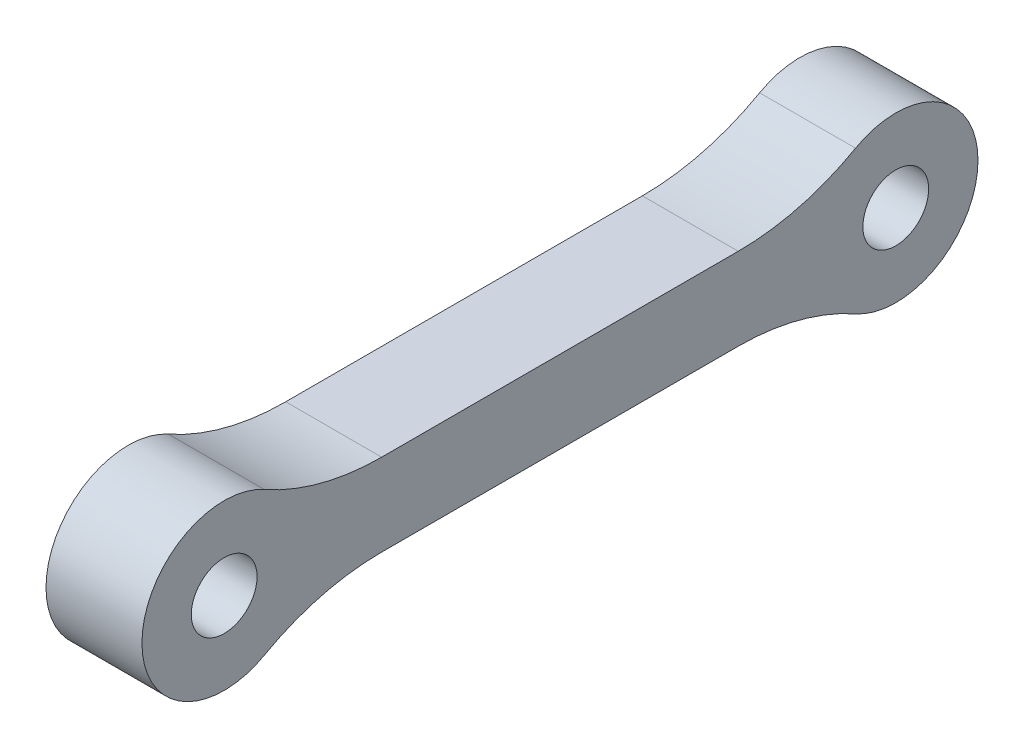
ISO-10303-21;
HEADER;
FILE_DESCRIPTION(('STEP AP214'),'2;1');
FILE_NAME('part.step','',(''),(''),'','','');
FILE_SCHEMA(('AUTOMOTIVE_DESIGN { 1 0 10303 214 1 1 1 1 }'));
ENDSEC;
DATA;
#1=APPLICATION_CONTEXT('core data for automotive mechanical design processes');
#2=APPLICATION_PROTOCOL_DEFINITION('international standard','automotive_design',2000,#1);
#3=PRODUCT_CONTEXT('',#1,'mechanical');
#4=PRODUCT('Part','Part','',(#3));
#5=PRODUCT_RELATED_PRODUCT_CATEGORY('part','',(#4));
#6=PRODUCT_DEFINITION_FORMATION('','',#4);
#7=PRODUCT_DEFINITION_CONTEXT('part definition',#1,'design');
#8=PRODUCT_DEFINITION('design','',#6,#7);
#9=PRODUCT_DEFINITION_SHAPE('','',#8);
#10=(LENGTH_UNIT() NAMED_UNIT(*) SI_UNIT(.MILLI.,.METRE.));
#11=(NAMED_UNIT(*) PLANE_ANGLE_UNIT() SI_UNIT($,.RADIAN.));
#12=(NAMED_UNIT(*) SI_UNIT($,.STERADIAN.) SOLID_ANGLE_UNIT());
#13=UNCERTAINTY_MEASURE_WITH_UNIT(LENGTH_MEASURE(1.E-05),#10,'distance_accuracy_value','');
#14=(GEOMETRIC_REPRESENTATION_CONTEXT(3) GLOBAL_UNCERTAINTY_ASSIGNED_CONTEXT((#13)) GLOBAL_UNIT_ASSIGNED_CONTEXT((#10,
#11,#12)) REPRESENTATION_CONTEXT('',''));
#15=CARTESIAN_POINT('',(0.,0.,0.));
#16=DIRECTION('',(0.,0.,1.));
#17=DIRECTION('',(1.,0.,0.));
#18=AXIS2_PLACEMENT_3D('',#15,#16,#17);
#19=CARTESIAN_POINT('',(4.,0.,0.));
#20=DIRECTION('',(1.,0.,0.));
#21=DIRECTION('',(0.,0.,-1.));
#22=AXIS2_PLACEMENT_3D('',#19,#20,#21);
#23=PLANE('',#22);
#24=CARTESIAN_POINT('',(4.,0.,0.));
#25=DIRECTION('',(1.,0.,0.));
#26=DIRECTION('',(0.,0.,-1.));
#27=AXIS2_PLACEMENT_3D('',#24,#25,#26);
#28=CIRCLE('',#27,1.37142857142857);
#29=CARTESIAN_POINT('',(4.,0.,-1.37142857142857));
#30=VERTEX_POINT('',#29);
#31=EDGE_CURVE('E132',#30,#30,#28,.T.);
#32=ORIENTED_EDGE('',*,*,#31,.F.);
#33=EDGE_LOOP('',(#32));
#34=FACE_BOUND('',#33,.T.);
#35=CARTESIAN_POINT('',(4.,0.,-28.));
#36=DIRECTION('',(1.,0.,0.));
#37=DIRECTION('',(0.,0.,-1.));
#38=AXIS2_PLACEMENT_3D('',#35,#36,#37);
#39=CIRCLE('',#38,3.42857142857143);
#40=CARTESIAN_POINT('',(4.,-2.99088145896657,-26.323775033229));
#41=VERTEX_POINT('',#40);
#42=CARTESIAN_POINT('',(4.,2.99088145896657,-26.323775033229));
#43=VERTEX_POINT('',#42);
#44=EDGE_CURVE('E141',#41,#43,#39,.T.);
#45=ORIENTED_EDGE('',*,*,#44,.T.);
#46=CARTESIAN_POINT('',(4.,11.7142857142857,-21.4347855468137));
#47=DIRECTION('',(1.,0.,0.));
#48=DIRECTION('',(0.,0.,-1.));
#49=AXIS2_PLACEMENT_3D('',#46,#47,#48);
#50=CIRCLE('',#49,10.);
#51=CARTESIAN_POINT('',(4.,1.71428571428571,-21.4347855468137));
#52=VERTEX_POINT('',#51);
#53=EDGE_CURVE('E11',#43,#52,#50,.F.);
#54=ORIENTED_EDGE('',*,*,#53,.T.);
#55=DIRECTION('',(0.,0.,1.));
#56=VECTOR('',#55,1.);
#57=CARTESIAN_POINT('',(4.,1.71428571428571,-18.));
#58=LINE('',#57,#56);
#59=CARTESIAN_POINT('',(4.,1.71428571428571,-6.56521445318633));
#60=VERTEX_POINT('',#59);
#61=EDGE_CURVE('E147',#52,#60,#58,.T.);
#62=ORIENTED_EDGE('',*,*,#61,.T.);
#63=CARTESIAN_POINT('',(4.,11.7142857142857,-6.56521445318633));
#64=DIRECTION('',(1.,0.,0.));
#65=DIRECTION('',(0.,0.,-1.));
#66=AXIS2_PLACEMENT_3D('',#63,#64,#65);
#67=CIRCLE('',#66,10.);
#68=CARTESIAN_POINT('',(4.,2.99088145896656,-1.67622496677098));
#69=VERTEX_POINT('',#68);
#70=EDGE_CURVE('E113',#60,#69,#67,.F.);
#71=ORIENTED_EDGE('',*,*,#70,.T.);
#72=CARTESIAN_POINT('',(4.,0.,0.));
#73=DIRECTION('',(1.,0.,0.));
#74=DIRECTION('',(0.,0.,-1.));
#75=AXIS2_PLACEMENT_3D('',#72,#73,#74);
#76=CIRCLE('',#75,3.42857142857143);
#77=CARTESIAN_POINT('',(4.,-2.99088145896657,-1.67622496677097));
#78=VERTEX_POINT('',#77);
#79=EDGE_CURVE('E123',#69,#78,#76,.T.);
#80=ORIENTED_EDGE('',*,*,#79,.T.);
#81=CARTESIAN_POINT('',(4.,-11.7142857142857,-6.56521445318631));
#82=DIRECTION('',(1.,0.,0.));
#83=DIRECTION('',(0.,0.,-1.));
#84=AXIS2_PLACEMENT_3D('',#81,#82,#83);
#85=CIRCLE('',#84,10.);
#86=CARTESIAN_POINT('',(4.,-1.71428571428571,-6.56521445318631));
#87=VERTEX_POINT('',#86);
#88=EDGE_CURVE('E162',#78,#87,#85,.F.);
#89=ORIENTED_EDGE('',*,*,#88,.T.);
#90=DIRECTION('',(0.,0.,-1.));
#91=VECTOR('',#90,1.);
#92=CARTESIAN_POINT('',(4.,-1.71428571428571,-18.));
#93=LINE('',#92,#91);
#94=CARTESIAN_POINT('',(4.,-1.71428571428571,-21.4347855468137));
#95=VERTEX_POINT('',#94);
#96=EDGE_CURVE('E178',#87,#95,#93,.T.);
#97=ORIENTED_EDGE('',*,*,#96,.T.);
#98=CARTESIAN_POINT('',(4.,-11.7142857142857,-21.4347855468137));
#99=DIRECTION('',(1.,0.,0.));
#100=DIRECTION('',(0.,0.,-1.));
#101=AXIS2_PLACEMENT_3D('',#98,#99,#100);
#102=CIRCLE('',#101,10.);
#103=EDGE_CURVE('E59',#95,#41,#102,.F.);
#104=ORIENTED_EDGE('',*,*,#103,.T.);
#105=EDGE_LOOP('',(#45,#54,#62,#71,#80,#89,#97,#104));
#106=FACE_BOUND('',#105,.T.);
#107=CARTESIAN_POINT('',(4.,0.,-28.));
#108=DIRECTION('',(1.,0.,0.));
#109=DIRECTION('',(0.,0.,-1.));
#110=AXIS2_PLACEMENT_3D('',#107,#108,#109);
#111=CIRCLE('',#110,1.37142857142856);
#112=CARTESIAN_POINT('',(4.,0.,-29.3714285714286));
#113=VERTEX_POINT('',#112);
#114=EDGE_CURVE('E324',#113,#113,#111,.T.);
#115=ORIENTED_EDGE('',*,*,#114,.F.);
#116=EDGE_LOOP('',(#115));
#117=FACE_BOUND('',#116,.T.);
#118=ADVANCED_FACE('F37',(#34,#106,#117),#23,.T.);
#119=CARTESIAN_POINT('',(0.,0.,0.));
#120=DIRECTION('',(1.,0.,0.));
#121=DIRECTION('',(0.,0.,-1.));
#122=AXIS2_PLACEMENT_3D('',#119,#120,#121);
#123=PLANE('',#122);
#124=CARTESIAN_POINT('',(0.,0.,0.));
#125=DIRECTION('',(1.,0.,0.));
#126=DIRECTION('',(0.,0.,-1.));
#127=AXIS2_PLACEMENT_3D('',#124,#125,#126);
#128=CIRCLE('',#127,3.42857142857143);
#129=CARTESIAN_POINT('',(0.,2.99088145896656,-1.67622496677098));
#130=VERTEX_POINT('',#129);
#131=CARTESIAN_POINT('',(0.,-2.99088145896657,-1.67622496677097));
#132=VERTEX_POINT('',#131);
#133=EDGE_CURVE('E120',#130,#132,#128,.T.);
#134=ORIENTED_EDGE('',*,*,#133,.F.);
#135=CARTESIAN_POINT('',(0.,11.7142857142857,-6.56521445318633));
#136=DIRECTION('',(1.,0.,0.));
#137=DIRECTION('',(0.,0.,-1.));
#138=AXIS2_PLACEMENT_3D('',#135,#136,#137);
#139=CIRCLE('',#138,10.);
#140=CARTESIAN_POINT('',(0.,1.71428571428571,-6.56521445318633));
#141=VERTEX_POINT('',#140);
#142=EDGE_CURVE('E103',#130,#141,#139,.T.);
#143=ORIENTED_EDGE('',*,*,#142,.T.);
#144=DIRECTION('',(0.,0.,1.));
#145=VECTOR('',#144,1.);
#146=CARTESIAN_POINT('',(0.,1.71428571428571,-18.));
#147=LINE('',#146,#145);
#148=CARTESIAN_POINT('',(0.,1.71428571428571,-21.4347855468137));
#149=VERTEX_POINT('',#148);
#150=EDGE_CURVE('E145',#149,#141,#147,.T.);
#151=ORIENTED_EDGE('',*,*,#150,.F.);
#152=CARTESIAN_POINT('',(0.,11.7142857142857,-21.4347855468137));
#153=DIRECTION('',(1.,0.,0.));
#154=DIRECTION('',(0.,0.,-1.));
#155=AXIS2_PLACEMENT_3D('',#152,#153,#154);
#156=CIRCLE('',#155,10.);
#157=CARTESIAN_POINT('',(0.,2.99088145896657,-26.323775033229));
#158=VERTEX_POINT('',#157);
#159=EDGE_CURVE('E45',#149,#158,#156,.T.);
#160=ORIENTED_EDGE('',*,*,#159,.T.);
#161=CARTESIAN_POINT('',(0.,0.,-28.));
#162=DIRECTION('',(1.,0.,0.));
#163=DIRECTION('',(0.,0.,-1.));
#164=AXIS2_PLACEMENT_3D('',#161,#162,#163);
#165=CIRCLE('',#164,3.42857142857143);
#166=CARTESIAN_POINT('',(0.,-2.99088145896657,-26.323775033229));
#167=VERTEX_POINT('',#166);
#168=EDGE_CURVE('E135',#167,#158,#165,.T.);
#169=ORIENTED_EDGE('',*,*,#168,.F.);
#170=CARTESIAN_POINT('',(0.,-11.7142857142857,-21.4347855468137));
#171=DIRECTION('',(1.,0.,0.));
#172=DIRECTION('',(0.,0.,-1.));
#173=AXIS2_PLACEMENT_3D('',#170,#171,#172);
#174=CIRCLE('',#173,10.);
#175=CARTESIAN_POINT('',(0.,-1.71428571428571,-21.4347855468137));
#176=VERTEX_POINT('',#175);
#177=EDGE_CURVE('E164',#167,#176,#174,.T.);
#178=ORIENTED_EDGE('',*,*,#177,.T.);
#179=DIRECTION('',(0.,0.,-1.));
#180=VECTOR('',#179,1.);
#181=CARTESIAN_POINT('',(0.,-1.71428571428571,-18.));
#182=LINE('',#181,#180);
#183=CARTESIAN_POINT('',(0.,-1.71428571428572,-6.56521445318631));
#184=VERTEX_POINT('',#183);
#185=EDGE_CURVE('E131',#184,#176,#182,.T.);
#186=ORIENTED_EDGE('',*,*,#185,.F.);
#187=CARTESIAN_POINT('',(0.,-11.7142857142857,-6.56521445318631));
#188=DIRECTION('',(1.,0.,0.));
#189=DIRECTION('',(0.,0.,-1.));
#190=AXIS2_PLACEMENT_3D('',#187,#188,#189);
#191=CIRCLE('',#190,10.);
#192=EDGE_CURVE('E130',#184,#132,#191,.T.);
#193=ORIENTED_EDGE('',*,*,#192,.T.);
#194=EDGE_LOOP('',(#134,#143,#151,#160,#169,#178,#186,#193));
#195=FACE_BOUND('',#194,.T.);
#196=CARTESIAN_POINT('',(0.,0.,0.));
#197=DIRECTION('',(1.,0.,0.));
#198=DIRECTION('',(0.,0.,-1.));
#199=AXIS2_PLACEMENT_3D('',#196,#197,#198);
#200=CIRCLE('',#199,1.37142857142857);
#201=CARTESIAN_POINT('',(0.,0.,-1.37142857142857));
#202=VERTEX_POINT('',#201);
#203=EDGE_CURVE('E138',#202,#202,#200,.T.);
#204=ORIENTED_EDGE('',*,*,#203,.T.);
#205=EDGE_LOOP('',(#204));
#206=FACE_BOUND('',#205,.T.);
#207=CARTESIAN_POINT('',(0.,0.,-28.));
#208=DIRECTION('',(1.,0.,0.));
#209=DIRECTION('',(0.,0.,-1.));
#210=AXIS2_PLACEMENT_3D('',#207,#208,#209);
#211=CIRCLE('',#210,1.37142857142856);
#212=CARTESIAN_POINT('',(0.,0.,-29.3714285714286));
#213=VERTEX_POINT('',#212);
#214=EDGE_CURVE('E327',#213,#213,#211,.T.);
#215=ORIENTED_EDGE('',*,*,#214,.T.);
#216=EDGE_LOOP('',(#215));
#217=FACE_BOUND('',#216,.T.);
#218=ADVANCED_FACE('F127',(#195,#206,#217),#123,.F.);
#219=CARTESIAN_POINT('',(4.,0.,0.));
#220=DIRECTION('',(-1.,0.,0.));
#221=DIRECTION('',(0.,0.,1.));
#222=AXIS2_PLACEMENT_3D('',#219,#220,#221);
#223=CYLINDRICAL_SURFACE('',#222,3.42857142857143);
#224=ORIENTED_EDGE('',*,*,#79,.F.);
#225=DIRECTION('',(-1.,0.,0.));
#226=VECTOR('',#225,1.);
#227=CARTESIAN_POINT('',(4.,2.99088145896656,-1.67622496677098));
#228=LINE('',#227,#226);
#229=EDGE_CURVE('E107',#69,#130,#228,.T.);
#230=ORIENTED_EDGE('',*,*,#229,.T.);
#231=ORIENTED_EDGE('',*,*,#133,.T.);
#232=DIRECTION('',(-1.,0.,0.));
#233=VECTOR('',#232,1.);
#234=CARTESIAN_POINT('',(4.,-2.99088145896657,-1.67622496677097));
#235=LINE('',#234,#233);
#236=EDGE_CURVE('E125',#132,#78,#235,.F.);
#237=ORIENTED_EDGE('',*,*,#236,.T.);
#238=EDGE_LOOP('',(#224,#230,#231,#237));
#239=FACE_BOUND('',#238,.T.);
#240=ADVANCED_FACE('F119',(#239),#223,.T.);
#241=CARTESIAN_POINT('',(4.,-1.71428571428571,-18.));
#242=DIRECTION('',(0.,1.,0.));
#243=DIRECTION('',(0.,0.,1.));
#244=AXIS2_PLACEMENT_3D('',#241,#242,#243);
#245=PLANE('',#244);
#246=ORIENTED_EDGE('',*,*,#96,.F.);
#247=DIRECTION('',(1.,0.,0.));
#248=VECTOR('',#247,1.);
#249=CARTESIAN_POINT('',(0.,-1.71428571428572,-6.56521445318631));
#250=LINE('',#249,#248);
#251=EDGE_CURVE('E154',#87,#184,#250,.F.);
#252=ORIENTED_EDGE('',*,*,#251,.T.);
#253=ORIENTED_EDGE('',*,*,#185,.T.);
#254=DIRECTION('',(1.,0.,0.));
#255=VECTOR('',#254,1.);
#256=CARTESIAN_POINT('',(4.,-1.71428571428571,-21.4347855468137));
#257=LINE('',#256,#255);
#258=EDGE_CURVE('E152',#176,#95,#257,.T.);
#259=ORIENTED_EDGE('',*,*,#258,.T.);
#260=EDGE_LOOP('',(#246,#252,#253,#259));
#261=FACE_BOUND('',#260,.T.);
#262=ADVANCED_FACE('F188',(#261),#245,.F.);
#263=CARTESIAN_POINT('',(4.,0.,-28.));
#264=DIRECTION('',(-1.,0.,0.));
#265=DIRECTION('',(0.,0.,1.));
#266=AXIS2_PLACEMENT_3D('',#263,#264,#265);
#267=CYLINDRICAL_SURFACE('',#266,3.42857142857143);
#268=ORIENTED_EDGE('',*,*,#44,.F.);
#269=DIRECTION('',(-1.,0.,0.));
#270=VECTOR('',#269,1.);
#271=CARTESIAN_POINT('',(4.,-2.99088145896657,-26.323775033229));
#272=LINE('',#271,#270);
#273=EDGE_CURVE('E114',#41,#167,#272,.T.);
#274=ORIENTED_EDGE('',*,*,#273,.T.);
#275=ORIENTED_EDGE('',*,*,#168,.T.);
#276=DIRECTION('',(-1.,0.,0.));
#277=VECTOR('',#276,1.);
#278=CARTESIAN_POINT('',(4.,2.99088145896657,-26.323775033229));
#279=LINE('',#278,#277);
#280=EDGE_CURVE('E52',#158,#43,#279,.F.);
#281=ORIENTED_EDGE('',*,*,#280,.T.);
#282=EDGE_LOOP('',(#268,#274,#275,#281));
#283=FACE_BOUND('',#282,.T.);
#284=ADVANCED_FACE('F169',(#283),#267,.T.);
#285=CARTESIAN_POINT('',(4.,1.71428571428571,-18.));
#286=DIRECTION('',(0.,-1.,0.));
#287=DIRECTION('',(0.,0.,-1.));
#288=AXIS2_PLACEMENT_3D('',#285,#286,#287);
#289=PLANE('',#288);
#290=ORIENTED_EDGE('',*,*,#150,.T.);
#291=DIRECTION('',(1.,0.,0.));
#292=VECTOR('',#291,1.);
#293=CARTESIAN_POINT('',(4.,1.71428571428571,-6.56521445318633));
#294=LINE('',#293,#292);
#295=EDGE_CURVE('E108',#141,#60,#294,.T.);
#296=ORIENTED_EDGE('',*,*,#295,.T.);
#297=ORIENTED_EDGE('',*,*,#61,.F.);
#298=DIRECTION('',(1.,0.,0.));
#299=VECTOR('',#298,1.);
#300=CARTESIAN_POINT('',(0.,1.71428571428571,-21.4347855468137));
#301=LINE('',#300,#299);
#302=EDGE_CURVE('E124',#52,#149,#301,.F.);
#303=ORIENTED_EDGE('',*,*,#302,.T.);
#304=EDGE_LOOP('',(#290,#296,#297,#303));
#305=FACE_BOUND('',#304,.T.);
#306=ADVANCED_FACE('F176',(#305),#289,.F.);
#307=CARTESIAN_POINT('',(4.,0.,0.));
#308=DIRECTION('',(-1.,0.,0.));
#309=DIRECTION('',(0.,0.,1.));
#310=AXIS2_PLACEMENT_3D('',#307,#308,#309);
#311=CYLINDRICAL_SURFACE('',#310,1.37142857142857);
#312=ORIENTED_EDGE('',*,*,#31,.T.);
#313=EDGE_LOOP('',(#312));
#314=FACE_BOUND('',#313,.T.);
#315=ORIENTED_EDGE('',*,*,#203,.F.);
#316=EDGE_LOOP('',(#315));
#317=FACE_BOUND('',#316,.T.);
#318=ADVANCED_FACE('F208',(#314,#317),#311,.F.);
#319=CARTESIAN_POINT('',(4.,0.,-28.));
#320=DIRECTION('',(-1.,0.,0.));
#321=DIRECTION('',(0.,0.,1.));
#322=AXIS2_PLACEMENT_3D('',#319,#320,#321);
#323=CYLINDRICAL_SURFACE('',#322,1.37142857142856);
#324=ORIENTED_EDGE('',*,*,#114,.T.);
#325=EDGE_LOOP('',(#324));
#326=FACE_BOUND('',#325,.T.);
#327=ORIENTED_EDGE('',*,*,#214,.F.);
#328=EDGE_LOOP('',(#327));
#329=FACE_BOUND('',#328,.T.);
#330=ADVANCED_FACE('F197',(#326,#329),#323,.F.);
#331=CARTESIAN_POINT('',(4.,11.7142857142857,-6.56521445318633));
#332=DIRECTION('',(-1.,0.,0.));
#333=DIRECTION('',(0.,0.,1.));
#334=AXIS2_PLACEMENT_3D('',#331,#332,#333);
#335=CYLINDRICAL_SURFACE('',#334,10.);
#336=ORIENTED_EDGE('',*,*,#70,.F.);
#337=ORIENTED_EDGE('',*,*,#295,.F.);
#338=ORIENTED_EDGE('',*,*,#142,.F.);
#339=ORIENTED_EDGE('',*,*,#229,.F.);
#340=EDGE_LOOP('',(#336,#337,#338,#339));
#341=FACE_BOUND('',#340,.T.);
#342=ADVANCED_FACE('F106',(#341),#335,.F.);
#343=CARTESIAN_POINT('',(4.,-11.7142857142857,-6.56521445318631));
#344=DIRECTION('',(-1.,0.,0.));
#345=DIRECTION('',(0.,0.,1.));
#346=AXIS2_PLACEMENT_3D('',#343,#344,#345);
#347=CYLINDRICAL_SURFACE('',#346,10.);
#348=ORIENTED_EDGE('',*,*,#88,.F.);
#349=ORIENTED_EDGE('',*,*,#236,.F.);
#350=ORIENTED_EDGE('',*,*,#192,.F.);
#351=ORIENTED_EDGE('',*,*,#251,.F.);
#352=EDGE_LOOP('',(#348,#349,#350,#351));
#353=FACE_BOUND('',#352,.T.);
#354=ADVANCED_FACE('F190',(#353),#347,.F.);
#355=CARTESIAN_POINT('',(4.,-11.7142857142857,-21.4347855468137));
#356=DIRECTION('',(-1.,0.,0.));
#357=DIRECTION('',(0.,0.,1.));
#358=AXIS2_PLACEMENT_3D('',#355,#356,#357);
#359=CYLINDRICAL_SURFACE('',#358,10.);
#360=ORIENTED_EDGE('',*,*,#103,.F.);
#361=ORIENTED_EDGE('',*,*,#258,.F.);
#362=ORIENTED_EDGE('',*,*,#177,.F.);
#363=ORIENTED_EDGE('',*,*,#273,.F.);
#364=EDGE_LOOP('',(#360,#361,#362,#363));
#365=FACE_BOUND('',#364,.T.);
#366=ADVANCED_FACE('F187',(#365),#359,.F.);
#367=CARTESIAN_POINT('',(4.,11.7142857142857,-21.4347855468137));
#368=DIRECTION('',(-1.,0.,0.));
#369=DIRECTION('',(0.,0.,1.));
#370=AXIS2_PLACEMENT_3D('',#367,#368,#369);
#371=CYLINDRICAL_SURFACE('',#370,10.);
#372=ORIENTED_EDGE('',*,*,#53,.F.);
#373=ORIENTED_EDGE('',*,*,#280,.F.);
#374=ORIENTED_EDGE('',*,*,#159,.F.);
#375=ORIENTED_EDGE('',*,*,#302,.F.);
#376=EDGE_LOOP('',(#372,#373,#374,#375));
#377=FACE_BOUND('',#376,.T.);
#378=ADVANCED_FACE('F39',(#377),#371,.F.);
#379=CLOSED_SHELL('',(#118,#218,#240,#262,#284,#306,#318,#330,#342,#354,#366,#378));
#380=MANIFOLD_SOLID_BREP('B2',#379);
#381=ADVANCED_BREP_SHAPE_REPRESENTATION('',(#18,#380),#14);
#382=SHAPE_DEFINITION_REPRESENTATION(#9,#381);
ENDSEC;
END-ISO-10303-21;
